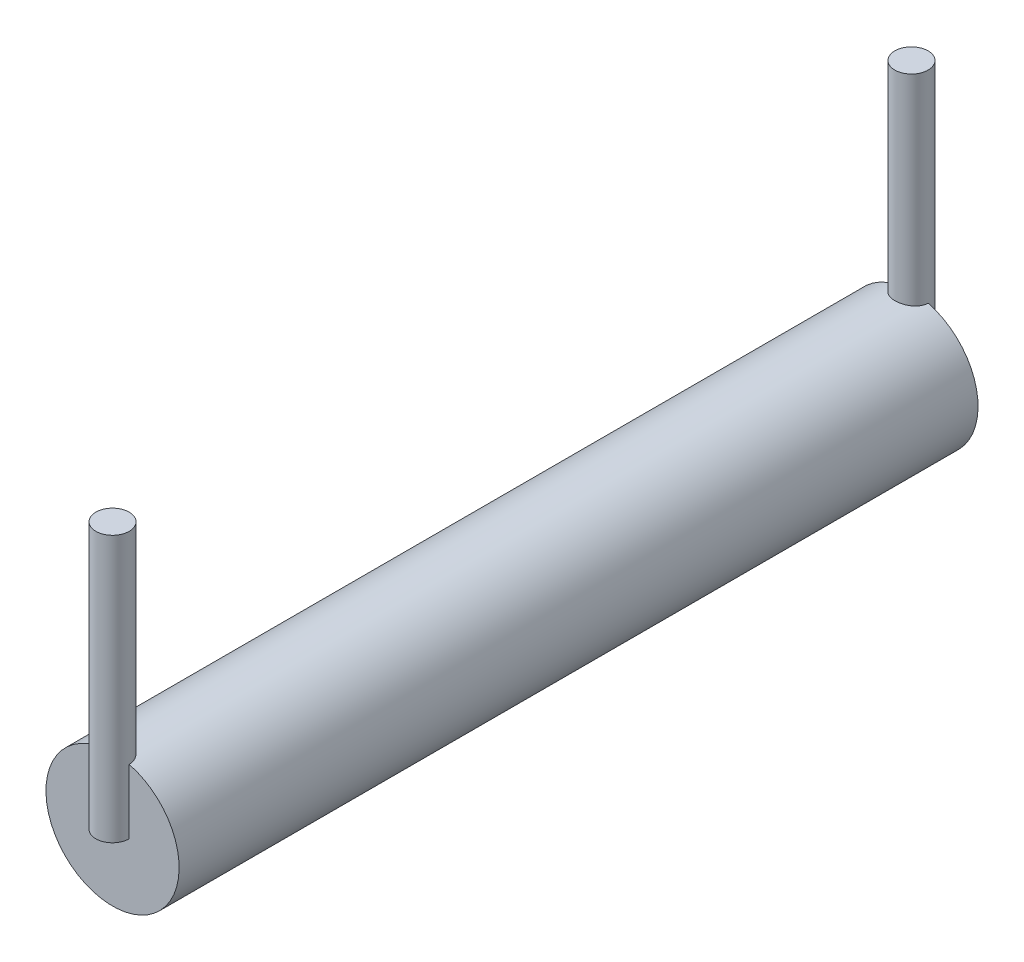
ISO-10303-21;
HEADER;
FILE_DESCRIPTION(('STEP AP214'),'2;1');
FILE_NAME('part.step','',(''),(''),'','','');
FILE_SCHEMA(('AUTOMOTIVE_DESIGN { 1 0 10303 214 1 1 1 1 }'));
ENDSEC;
DATA;
#1=APPLICATION_CONTEXT('core data for automotive mechanical design processes');
#2=APPLICATION_PROTOCOL_DEFINITION('international standard','automotive_design',2000,#1);
#3=PRODUCT_CONTEXT('',#1,'mechanical');
#4=PRODUCT('Part','Part','',(#3));
#5=PRODUCT_RELATED_PRODUCT_CATEGORY('part','',(#4));
#6=PRODUCT_DEFINITION_FORMATION('','',#4);
#7=PRODUCT_DEFINITION_CONTEXT('part definition',#1,'design');
#8=PRODUCT_DEFINITION('design','',#6,#7);
#9=PRODUCT_DEFINITION_SHAPE('','',#8);
#10=(LENGTH_UNIT() NAMED_UNIT(*) SI_UNIT(.MILLI.,.METRE.));
#11=(NAMED_UNIT(*) PLANE_ANGLE_UNIT() SI_UNIT($,.RADIAN.));
#12=(NAMED_UNIT(*) SI_UNIT($,.STERADIAN.) SOLID_ANGLE_UNIT());
#13=UNCERTAINTY_MEASURE_WITH_UNIT(LENGTH_MEASURE(1.E-05),#10,'distance_accuracy_value','');
#14=(GEOMETRIC_REPRESENTATION_CONTEXT(3) GLOBAL_UNCERTAINTY_ASSIGNED_CONTEXT((#13)) GLOBAL_UNIT_ASSIGNED_CONTEXT((#10,
#11,#12)) REPRESENTATION_CONTEXT('',''));
#15=CARTESIAN_POINT('',(0.,0.,0.));
#16=DIRECTION('',(0.,0.,1.));
#17=DIRECTION('',(1.,0.,0.));
#18=AXIS2_PLACEMENT_3D('',#15,#16,#17);
#19=CARTESIAN_POINT('',(0.,0.,6.));
#20=DIRECTION('',(0.,0.,-1.));
#21=DIRECTION('',(-1.,0.,0.));
#22=AXIS2_PLACEMENT_3D('',#19,#20,#21);
#23=CYLINDRICAL_SURFACE('',#22,1.);
#24=CARTESIAN_POINT('',(0.25,0.968245836551854,6.));
#25=CARTESIAN_POINT('',(0.250012953215811,0.968234049545618,5.98616929392187));
#26=CARTESIAN_POINT('',(0.24885316138895,0.968541877962347,5.97234724785924));
#27=CARTESIAN_POINT('',(0.244289832798706,0.969707324249105,5.94513005638073));
#28=CARTESIAN_POINT('',(0.240890858126015,0.970563824163099,5.93173410090205));
#29=CARTESIAN_POINT('',(0.231950584629502,0.9727377402555,5.905720613366));
#30=CARTESIAN_POINT('',(0.22640948712533,0.974055113119327,5.89310300828736));
#31=CARTESIAN_POINT('',(0.213353558724008,0.976998055593672,5.86897165994385));
#32=CARTESIAN_POINT('',(0.205838198568213,0.978623707814904,5.85745821381248));
#33=CARTESIAN_POINT('',(0.188871196749019,0.982040595501114,5.83561416128196));
#34=CARTESIAN_POINT('',(0.179384338319468,0.983834461354369,5.82531131376196));
#35=CARTESIAN_POINT('',(0.158818924002209,0.987362777210994,5.80642444230034));
#36=CARTESIAN_POINT('',(0.147740114172736,0.989097217680292,5.79784069310636));
#37=CARTESIAN_POINT('',(0.124114230626836,0.992340451273177,5.78252225925484));
#38=CARTESIAN_POINT('',(0.111548836630201,0.993845760516911,5.77581502859025));
#39=CARTESIAN_POINT('',(0.0854256461644509,0.996430866813653,5.76461881386509));
#40=CARTESIAN_POINT('',(0.0718680456103875,0.997510747601812,5.76012939323882));
#41=CARTESIAN_POINT('',(0.044436027533346,0.999104749704139,5.75358525247797));
#42=CARTESIAN_POINT('',(0.0305735806083575,0.999629882170623,5.7514830820743));
#43=CARTESIAN_POINT('',(0.00268319381278957,1.00009359545966,5.74962415693419));
#44=CARTESIAN_POINT('',(-0.0113447250357142,1.00003225000546,5.74986710740419));
#45=CARTESIAN_POINT('',(-0.03883812321512,0.999338093392974,5.75265749096803));
#46=CARTESIAN_POINT('',(-0.0523091754274912,0.99871799668788,5.75515365416239));
#47=CARTESIAN_POINT('',(-0.0786346777785578,0.996990826596762,5.76229716978316));
#48=CARTESIAN_POINT('',(-0.0914891006079824,0.995883731664611,5.76694461738872));
#49=CARTESIAN_POINT('',(-0.116351821504132,0.993287494403769,5.77830032017112));
#50=CARTESIAN_POINT('',(-0.128351407400121,0.991794984571589,5.78502684855936));
#51=CARTESIAN_POINT('',(-0.151069157807944,0.988589863852097,5.80033578245722));
#52=CARTESIAN_POINT('',(-0.161787128890332,0.986877219821464,5.80891846756218));
#53=CARTESIAN_POINT('',(-0.18194234742737,0.983363915069006,5.82796972802148));
#54=CARTESIAN_POINT('',(-0.191337275764998,0.981562126239374,5.83848290913844));
#55=CARTESIAN_POINT('',(-0.208242393795093,0.978115420664843,5.86095746672845));
#56=CARTESIAN_POINT('',(-0.215752067555647,0.976470546938616,5.87291923830811));
#57=CARTESIAN_POINT('',(-0.228701177325653,0.973519534135929,5.8980363994659));
#58=CARTESIAN_POINT('',(-0.234129254490506,0.972215265658711,5.911197866266));
#59=CARTESIAN_POINT('',(-0.242675587980693,0.970117647619827,5.93827923214636));
#60=CARTESIAN_POINT('',(-0.24579729730641,0.969323534507774,5.95219796379713));
#61=CARTESIAN_POINT('',(-0.248476158786593,0.968638226662377,5.97186434518736));
#62=CARTESIAN_POINT('',(-0.249047697741106,0.968491307756439,5.97747992580211));
#63=CARTESIAN_POINT('',(-0.249809189424918,0.968295156243113,5.98872944747851));
#64=CARTESIAN_POINT('',(-0.249999759525152,0.968245765589992,5.99436334399119));
#65=CARTESIAN_POINT('',(-0.250000000000009,0.968245836551973,6.));
#66=B_SPLINE_CURVE_WITH_KNOTS('',3,(#24,#25,#26,#27,#28,#29,#30,#31,#32,#33,#34,#35,#36,#37,#38,
#39,#40,#41,#42,#43,#44,#45,#46,#47,#48,#49,#50,#51,#52,#53,#54,#55,#56,#57,#58,#59,#60,#61,#62,
#63,#64,#65),.UNSPECIFIED.,.F.,.F.,(4,2,2,2,2,2,2,2,2,2,2,2,2,2,2,2,2,2,2,2,4),(0.,
0.0414268569974917,0.0827695712464079,0.12410840099436,0.165458324149683,0.20762255482499,
0.249793518852794,0.292552548213583,0.335303157299057,0.377188284256308,0.419068146109593,
0.460018444166184,0.500970554157591,0.542293354093937,0.583622382878818,0.626065654304351,
0.668520528420415,0.711203880860886,0.75382319929698,0.770751702253637,0.787652749776196),.UNSPECIFIED.);
#67=CARTESIAN_POINT('',(0.25,0.968245836551854,6.));
#68=VERTEX_POINT('',#67);
#69=CARTESIAN_POINT('',(-0.25,0.968245836551854,6.));
#70=VERTEX_POINT('',#69);
#71=EDGE_CURVE('E116',#68,#70,#66,.T.);
#72=ORIENTED_EDGE('',*,*,#71,.F.);
#73=CARTESIAN_POINT('',(0.,0.,6.));
#74=DIRECTION('',(0.,0.,1.));
#75=DIRECTION('',(1.,0.,0.));
#76=AXIS2_PLACEMENT_3D('',#73,#74,#75);
#77=CIRCLE('',#76,1.);
#78=EDGE_CURVE('E121',#70,#68,#77,.T.);
#79=ORIENTED_EDGE('',*,*,#78,.F.);
#80=EDGE_LOOP('',(#72,#79));
#81=FACE_BOUND('',#80,.T.);
#82=CARTESIAN_POINT('',(0.,1.,-6.25));
#83=CARTESIAN_POINT('',(-0.0138126814449552,0.999999766446688,-6.24999961237697));
#84=CARTESIAN_POINT('',(-0.0276296929717939,0.999710963553047,-6.24885140820437));
#85=CARTESIAN_POINT('',(-0.0548677206284222,0.998586856383154,-6.2442958081155));
#86=CARTESIAN_POINT('',(-0.0682885078117899,0.997751242366614,-6.24088713174369));
#87=CARTESIAN_POINT('',(-0.0943368120304295,0.995626043886733,-6.23192679108965));
#88=CARTESIAN_POINT('',(-0.106965260571667,0.994337004736811,-6.22637770021412));
#89=CARTESIAN_POINT('',(-0.131112021984071,0.991442239679321,-6.21330310165919));
#90=CARTESIAN_POINT('',(-0.14263029739146,0.989836503090084,-6.20577752731351));
#91=CARTESIAN_POINT('',(-0.164466987883487,0.986445689319669,-6.18879986839096));
#92=CARTESIAN_POINT('',(-0.174759281676846,0.984657845247555,-6.1793147375068));
#93=CARTESIAN_POINT('',(-0.193624821200551,0.981122700195882,-6.15875796584851));
#94=CARTESIAN_POINT('',(-0.202197872824856,0.979375403813914,-6.14768614617558));
#95=CARTESIAN_POINT('',(-0.217504423799839,0.976091292832851,-6.12406746221043));
#96=CARTESIAN_POINT('',(-0.224208702654226,0.974557990784342,-6.11150112819827));
#97=CARTESIAN_POINT('',(-0.235399484758421,0.971915824687039,-6.08537526472361));
#98=CARTESIAN_POINT('',(-0.239886342573222,0.970806892787981,-6.07181589444571));
#99=CARTESIAN_POINT('',(-0.246425806134048,0.969167461195918,-6.04437608363292));
#100=CARTESIAN_POINT('',(-0.248525378055557,0.968625818459043,-6.03050751732503));
#101=CARTESIAN_POINT('',(-0.250376962511309,0.968148937562901,-6.00260523849767));
#102=CARTESIAN_POINT('',(-0.250129356969663,0.96821360074774,-5.9885715532169));
#103=CARTESIAN_POINT('',(-0.24733108743988,0.96893200916103,-5.96109736537592));
#104=CARTESIAN_POINT('',(-0.244836390031753,0.969571438336465,-5.94765072975582));
#105=CARTESIAN_POINT('',(-0.237704031150518,0.971344516127473,-5.92137315818145));
#106=CARTESIAN_POINT('',(-0.233066217011571,0.972478199951161,-5.90854226616184));
#107=CARTESIAN_POINT('',(-0.221731579656192,0.975125189840311,-5.88371033062466));
#108=CARTESIAN_POINT('',(-0.215014444538818,0.976642212449035,-5.87171897136841));
#109=CARTESIAN_POINT('',(-0.199726046002492,0.979882851410643,-5.84901354837386));
#110=CARTESIAN_POINT('',(-0.191154458134806,0.981606503891225,-5.83829970865546));
#111=CARTESIAN_POINT('',(-0.172110570780203,0.985126467566302,-5.8181327307176));
#112=CARTESIAN_POINT('',(-0.161591043027643,0.986923449129952,-5.80872425165644));
#113=CARTESIAN_POINT('',(-0.139101986250617,0.990343275964643,-5.79179645958935));
#114=CARTESIAN_POINT('',(-0.127132412951324,0.991966115915692,-5.78427720428941));
#115=CARTESIAN_POINT('',(-0.102019314780232,0.994862886823637,-5.77132490229594));
#116=CARTESIAN_POINT('',(-0.0888718988681043,0.996135600212875,-5.7658991099576));
#117=CARTESIAN_POINT('',(-0.0618126680238143,0.998179861652364,-5.75734711571507));
#118=CARTESIAN_POINT('',(-0.0479009998584145,0.998951505565468,-5.75422047393031));
#119=CARTESIAN_POINT('',(-0.0200899950650046,0.999892498785624,-5.75042373907353));
#120=CARTESIAN_POINT('',(-0.0061994533313684,1.00007675584713,-5.74969282898745));
#121=CARTESIAN_POINT('',(0.0215054791335847,0.999864674690751,-5.75054150034258));
#122=CARTESIAN_POINT('',(0.0353198766074326,0.999468388736411,-5.75212087379986));
#123=CARTESIAN_POINT('',(0.0622690447960822,0.998149301878928,-5.75749515139856));
#124=CARTESIAN_POINT('',(0.0754108531614594,0.997234390309685,-5.76125687724616));
#125=CARTESIAN_POINT('',(0.100876215408752,0.994981177723557,-5.77085118067141));
#126=CARTESIAN_POINT('',(0.113199686505439,0.99364283394982,-5.77668396738553));
#127=CARTESIAN_POINT('',(0.136920522404975,0.990655513210517,-5.79037268814579));
#128=CARTESIAN_POINT('',(0.148297573639305,0.989001445611554,-5.79826268539946));
#129=CARTESIAN_POINT('',(0.169587768940541,0.985574181979032,-5.81579831813283));
#130=CARTESIAN_POINT('',(0.179500659828835,0.983800965419508,-5.82544425660282));
#131=CARTESIAN_POINT('',(0.197831761345455,0.980281594934618,-5.84650032680741));
#132=CARTESIAN_POINT('',(0.206207311270339,0.978537173645468,-5.8579479505004));
#133=CARTESIAN_POINT('',(0.22091845983545,0.975321463962064,-5.88212210574429));
#134=CARTESIAN_POINT('',(0.227254149026323,0.973850163445043,-5.89484858049329));
#135=CARTESIAN_POINT('',(0.237658570101549,0.971363491224442,-5.92115095373551));
#136=CARTESIAN_POINT('',(0.241740732775678,0.970345425486509,-5.93472127139067));
#137=CARTESIAN_POINT('',(0.247557609992297,0.968877906816972,-5.96238493964819));
#138=CARTESIAN_POINT('',(0.24929283791311,0.968428329533227,-5.97647817517208));
#139=CARTESIAN_POINT('',(0.250339765055666,0.968158168673261,-6.00435350397587));
#140=CARTESIAN_POINT('',(0.24971964963002,0.968319887880439,-6.01813290585412));
#141=CARTESIAN_POINT('',(0.246229546385478,0.969213181679738,-6.04538398144466));
#142=CARTESIAN_POINT('',(0.243359603781128,0.969944744819761,-6.05885566133561));
#143=CARTESIAN_POINT('',(0.235488553240466,0.971885434471204,-6.08503474317757));
#144=CARTESIAN_POINT('',(0.230500234113396,0.973091692060515,-6.09774621754003));
#145=CARTESIAN_POINT('',(0.218544152267512,0.975846259541381,-6.12216089711895));
#146=CARTESIAN_POINT('',(0.211576115005698,0.977394616867955,-6.13386396219782));
#147=CARTESIAN_POINT('',(0.195644624772856,0.980709390439187,-6.15625910483367));
#148=CARTESIAN_POINT('',(0.186633860485376,0.982480441386262,-6.16691684557066));
#149=CARTESIAN_POINT('',(0.166964895198289,0.98601337874381,-6.18659117413257));
#150=CARTESIAN_POINT('',(0.156306303543524,0.987775262878433,-6.19560737168549));
#151=CARTESIAN_POINT('',(0.133411264450431,0.991129426079438,-6.21190188476077));
#152=CARTESIAN_POINT('',(0.121149737052731,0.99271805560978,-6.21914576894526));
#153=CARTESIAN_POINT('',(0.095544343251746,0.995508208291864,-6.23145791049009));
#154=CARTESIAN_POINT('',(0.08220126057279,0.996710008666302,-6.23652772677476));
#155=CARTESIAN_POINT('',(0.057401708873912,0.998413432609236,-6.24359530505494));
#156=CARTESIAN_POINT('',(0.0460633618180114,0.999004308421151,-6.24599187384224));
#157=CARTESIAN_POINT('',(0.0231510119227138,0.99979767538658,-6.24919432393699));
#158=CARTESIAN_POINT('',(0.0115770268737693,1.00000019575149,-6.25000032488422));
#159=CARTESIAN_POINT('',(0.,1.,-6.25));
#160=B_SPLINE_CURVE_WITH_KNOTS('',3,(#82,#83,#84,#85,#86,#87,#88,#89,#90,#91,#92,#93,#94,#95,
#96,#97,#98,#99,#100,#101,#102,#103,#104,#105,#106,#107,#108,#109,#110,#111,#112,#113,#114,#115,
#116,#117,#118,#119,#120,#121,#122,#123,#124,#125,#126,#127,#128,#129,#130,#131,#132,#133,#134,
#135,#136,#137,#138,#139,#140,#141,#142,#143,#144,#145,#146,#147,#148,#149,#150,#151,#152,#153,
#154,#155,#156,#157,#158,#159),.UNSPECIFIED.,.T.,.F.,(4,2,2,2,2,2,2,2,2,2,2,2,2,2,2,2,2,2,2,2,2,
2,2,2,2,2,2,2,2,2,2,2,2,2,2,2,2,2,4),(0.,0.041395618745315,0.0828147062939834,0.124184150381018,
0.165554990028222,0.207690725728566,0.24983121596677,0.292597745909677,0.33535743528228,
0.377260491832385,0.419156730187829,0.460037495011696,0.500921172443397,0.542217546456466,
0.583521151393605,0.626002501615032,0.668485149263745,0.711113715015189,0.753734122814405,
0.795263848248794,0.836789835187905,0.877700457523396,0.918615212203818,0.960255979275587,
1.0019039383467,1.04457418200746,1.08724253124918,1.12965375769006,1.17205570542068,
1.21323963399769,1.25442273492672,1.29536066759908,1.33630428022817,1.37831596068318,
1.42033761628403,1.46312030916598,1.50587227303558,1.54057040490358,1.5752659267384),.UNSPECIFIED.);
#161=CARTESIAN_POINT('',(-0.25,0.968245836551854,-6.));
#162=VERTEX_POINT('',#161);
#163=CARTESIAN_POINT('',(0.25,0.968245836551854,-6.));
#164=VERTEX_POINT('',#163);
#165=EDGE_CURVE('E55',#162,#164,#160,.T.);
#166=ORIENTED_EDGE('',*,*,#165,.F.);
#167=CARTESIAN_POINT('',(0.,0.,-6.));
#168=DIRECTION('',(0.,0.,1.));
#169=DIRECTION('',(1.,0.,0.));
#170=AXIS2_PLACEMENT_3D('',#167,#168,#169);
#171=CIRCLE('',#170,1.);
#172=EDGE_CURVE('E73',#162,#164,#171,.T.);
#173=ORIENTED_EDGE('',*,*,#172,.T.);
#174=EDGE_LOOP('',(#166,#173));
#175=FACE_BOUND('',#174,.T.);
#176=ADVANCED_FACE('F33',(#81,#175),#23,.T.);
#177=CARTESIAN_POINT('',(0.,0.,-6.));
#178=DIRECTION('',(0.,0.,1.));
#179=DIRECTION('',(1.,0.,0.));
#180=AXIS2_PLACEMENT_3D('',#177,#178,#179);
#181=PLANE('',#180);
#182=DIRECTION('',(0.,-1.,0.));
#183=VECTOR('',#182,1.);
#184=CARTESIAN_POINT('',(-0.25,4.,-6.));
#185=LINE('',#184,#183);
#186=CARTESIAN_POINT('',(-0.25,0.,-6.));
#187=VERTEX_POINT('',#186);
#188=EDGE_CURVE('E11',#187,#162,#185,.F.);
#189=ORIENTED_EDGE('',*,*,#188,.F.);
#190=DIRECTION('',(-1.,0.,0.));
#191=VECTOR('',#190,1.);
#192=CARTESIAN_POINT('',(0.,0.,-6.));
#193=LINE('',#192,#191);
#194=CARTESIAN_POINT('',(0.25,0.,-6.));
#195=VERTEX_POINT('',#194);
#196=EDGE_CURVE('E48',#195,#187,#193,.T.);
#197=ORIENTED_EDGE('',*,*,#196,.F.);
#198=DIRECTION('',(0.,-1.,0.));
#199=VECTOR('',#198,1.);
#200=CARTESIAN_POINT('',(0.25,4.,-6.));
#201=LINE('',#200,#199);
#202=EDGE_CURVE('E41',#164,#195,#201,.T.);
#203=ORIENTED_EDGE('',*,*,#202,.F.);
#204=ORIENTED_EDGE('',*,*,#172,.F.);
#205=EDGE_LOOP('',(#189,#197,#203,#204));
#206=FACE_BOUND('',#205,.T.);
#207=ADVANCED_FACE('F72',(#206),#181,.F.);
#208=CARTESIAN_POINT('',(0.,0.,6.));
#209=DIRECTION('',(0.,0.,1.));
#210=DIRECTION('',(1.,0.,0.));
#211=AXIS2_PLACEMENT_3D('',#208,#209,#210);
#212=PLANE('',#211);
#213=DIRECTION('',(-1.,0.,0.));
#214=VECTOR('',#213,1.);
#215=CARTESIAN_POINT('',(0.,0.,6.));
#216=LINE('',#215,#214);
#217=CARTESIAN_POINT('',(0.25,0.,6.));
#218=VERTEX_POINT('',#217);
#219=CARTESIAN_POINT('',(-0.25,0.,6.));
#220=VERTEX_POINT('',#219);
#221=EDGE_CURVE('E124',#218,#220,#216,.T.);
#222=ORIENTED_EDGE('',*,*,#221,.T.);
#223=DIRECTION('',(0.,-1.,0.));
#224=VECTOR('',#223,1.);
#225=CARTESIAN_POINT('',(-0.25,4.,6.));
#226=LINE('',#225,#224);
#227=EDGE_CURVE('E80',#220,#70,#226,.F.);
#228=ORIENTED_EDGE('',*,*,#227,.T.);
#229=ORIENTED_EDGE('',*,*,#78,.T.);
#230=DIRECTION('',(0.,-1.,0.));
#231=VECTOR('',#230,1.);
#232=CARTESIAN_POINT('',(0.25,4.,6.));
#233=LINE('',#232,#231);
#234=EDGE_CURVE('E128',#68,#218,#233,.T.);
#235=ORIENTED_EDGE('',*,*,#234,.T.);
#236=EDGE_LOOP('',(#222,#228,#229,#235));
#237=FACE_BOUND('',#236,.T.);
#238=ADVANCED_FACE('F113',(#237),#212,.T.);
#239=CARTESIAN_POINT('',(0.,4.,6.));
#240=DIRECTION('',(0.,-1.,0.));
#241=DIRECTION('',(0.,0.,-1.));
#242=AXIS2_PLACEMENT_3D('',#239,#240,#241);
#243=CYLINDRICAL_SURFACE('',#242,0.25);
#244=ORIENTED_EDGE('',*,*,#227,.F.);
#245=CARTESIAN_POINT('',(0.,0.,6.));
#246=DIRECTION('',(0.,1.,0.));
#247=DIRECTION('',(0.,0.,1.));
#248=AXIS2_PLACEMENT_3D('',#245,#246,#247);
#249=CIRCLE('',#248,0.25);
#250=EDGE_CURVE('E92',#220,#218,#249,.T.);
#251=ORIENTED_EDGE('',*,*,#250,.T.);
#252=ORIENTED_EDGE('',*,*,#234,.F.);
#253=ORIENTED_EDGE('',*,*,#71,.T.);
#254=EDGE_LOOP('',(#244,#251,#252,#253));
#255=FACE_BOUND('',#254,.T.);
#256=CARTESIAN_POINT('',(0.,4.,6.));
#257=DIRECTION('',(0.,1.,0.));
#258=DIRECTION('',(0.,0.,1.));
#259=AXIS2_PLACEMENT_3D('',#256,#257,#258);
#260=CIRCLE('',#259,0.25);
#261=CARTESIAN_POINT('',(0.,4.,6.25));
#262=VERTEX_POINT('',#261);
#263=EDGE_CURVE('E93',#262,#262,#260,.T.);
#264=ORIENTED_EDGE('',*,*,#263,.F.);
#265=EDGE_LOOP('',(#264));
#266=FACE_BOUND('',#265,.T.);
#267=ADVANCED_FACE('F105',(#255,#266),#243,.T.);
#268=CARTESIAN_POINT('',(0.,4.,6.));
#269=DIRECTION('',(0.,1.,0.));
#270=DIRECTION('',(0.,0.,1.));
#271=AXIS2_PLACEMENT_3D('',#268,#269,#270);
#272=PLANE('',#271);
#273=ORIENTED_EDGE('',*,*,#263,.T.);
#274=EDGE_LOOP('',(#273));
#275=FACE_BOUND('',#274,.T.);
#276=ADVANCED_FACE('F102',(#275),#272,.T.);
#277=CARTESIAN_POINT('',(0.,0.,6.));
#278=DIRECTION('',(0.,1.,0.));
#279=DIRECTION('',(0.,0.,1.));
#280=AXIS2_PLACEMENT_3D('',#277,#278,#279);
#281=PLANE('',#280);
#282=ORIENTED_EDGE('',*,*,#221,.F.);
#283=ORIENTED_EDGE('',*,*,#250,.F.);
#284=EDGE_LOOP('',(#282,#283));
#285=FACE_BOUND('',#284,.T.);
#286=ADVANCED_FACE('F99',(#285),#281,.F.);
#287=CARTESIAN_POINT('',(0.,4.,-6.));
#288=DIRECTION('',(0.,-1.,0.));
#289=DIRECTION('',(0.,0.,-1.));
#290=AXIS2_PLACEMENT_3D('',#287,#288,#289);
#291=CYLINDRICAL_SURFACE('',#290,0.25);
#292=CARTESIAN_POINT('',(0.,4.,-6.));
#293=DIRECTION('',(0.,1.,0.));
#294=DIRECTION('',(0.,0.,1.));
#295=AXIS2_PLACEMENT_3D('',#292,#293,#294);
#296=CIRCLE('',#295,0.25);
#297=CARTESIAN_POINT('',(0.,4.,-5.75));
#298=VERTEX_POINT('',#297);
#299=EDGE_CURVE('E83',#298,#298,#296,.T.);
#300=ORIENTED_EDGE('',*,*,#299,.F.);
#301=EDGE_LOOP('',(#300));
#302=FACE_BOUND('',#301,.T.);
#303=CARTESIAN_POINT('',(0.,0.,-6.));
#304=DIRECTION('',(0.,1.,0.));
#305=DIRECTION('',(0.,0.,1.));
#306=AXIS2_PLACEMENT_3D('',#303,#304,#305);
#307=CIRCLE('',#306,0.25);
#308=EDGE_CURVE('E79',#195,#187,#307,.T.);
#309=ORIENTED_EDGE('',*,*,#308,.T.);
#310=ORIENTED_EDGE('',*,*,#188,.T.);
#311=ORIENTED_EDGE('',*,*,#165,.T.);
#312=ORIENTED_EDGE('',*,*,#202,.T.);
#313=EDGE_LOOP('',(#309,#310,#311,#312));
#314=FACE_BOUND('',#313,.T.);
#315=ADVANCED_FACE('F82',(#302,#314),#291,.T.);
#316=CARTESIAN_POINT('',(0.,0.,-6.));
#317=DIRECTION('',(0.,1.,0.));
#318=DIRECTION('',(0.,0.,1.));
#319=AXIS2_PLACEMENT_3D('',#316,#317,#318);
#320=PLANE('',#319);
#321=ORIENTED_EDGE('',*,*,#308,.F.);
#322=ORIENTED_EDGE('',*,*,#196,.T.);
#323=EDGE_LOOP('',(#321,#322));
#324=FACE_BOUND('',#323,.T.);
#325=ADVANCED_FACE('F78',(#324),#320,.F.);
#326=CARTESIAN_POINT('',(0.,4.,-6.));
#327=DIRECTION('',(0.,1.,0.));
#328=DIRECTION('',(0.,0.,1.));
#329=AXIS2_PLACEMENT_3D('',#326,#327,#328);
#330=PLANE('',#329);
#331=ORIENTED_EDGE('',*,*,#299,.T.);
#332=EDGE_LOOP('',(#331));
#333=FACE_BOUND('',#332,.T.);
#334=ADVANCED_FACE('F172',(#333),#330,.T.);
#335=CLOSED_SHELL('',(#176,#207,#238,#267,#276,#286,#315,#325,#334));
#336=MANIFOLD_SOLID_BREP('B2',#335);
#337=ADVANCED_BREP_SHAPE_REPRESENTATION('',(#18,#336),#14);
#338=SHAPE_DEFINITION_REPRESENTATION(#9,#337);
ENDSEC;
END-ISO-10303-21;
